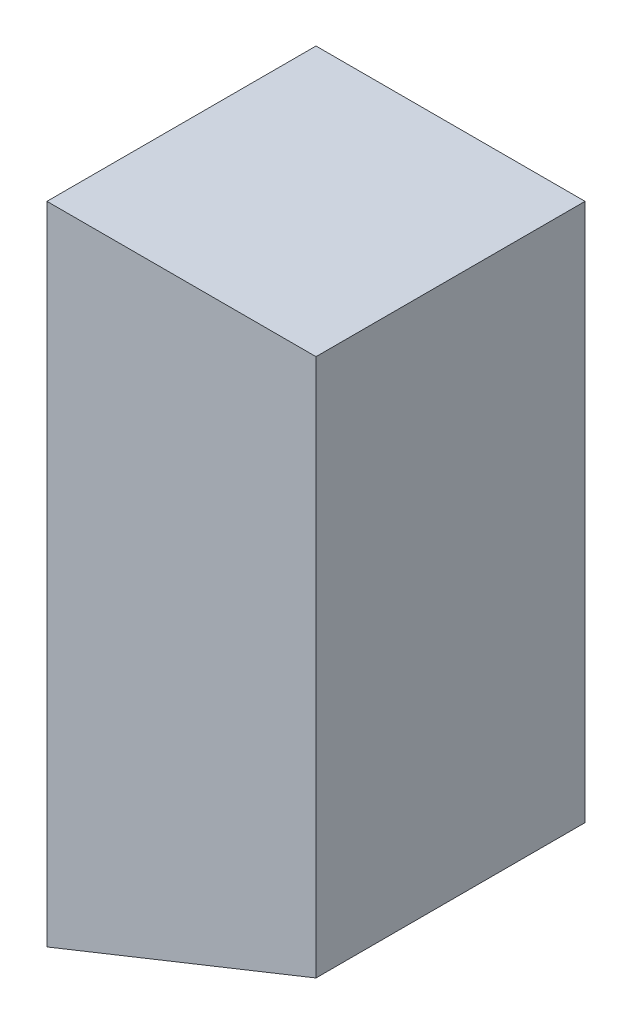
ISO-10303-21;
HEADER;
FILE_DESCRIPTION(('STEP AP214'),'2;1');
FILE_NAME('part.step','',(''),(''),'','','');
FILE_SCHEMA(('AUTOMOTIVE_DESIGN { 1 0 10303 214 1 1 1 1 }'));
ENDSEC;
DATA;
#1=APPLICATION_CONTEXT('core data for automotive mechanical design processes');
#2=APPLICATION_PROTOCOL_DEFINITION('international standard','automotive_design',2000,#1);
#3=PRODUCT_CONTEXT('',#1,'mechanical');
#4=PRODUCT('Part','Part','',(#3));
#5=PRODUCT_RELATED_PRODUCT_CATEGORY('part','',(#4));
#6=PRODUCT_DEFINITION_FORMATION('','',#4);
#7=PRODUCT_DEFINITION_CONTEXT('part definition',#1,'design');
#8=PRODUCT_DEFINITION('design','',#6,#7);
#9=PRODUCT_DEFINITION_SHAPE('','',#8);
#10=(LENGTH_UNIT() NAMED_UNIT(*) SI_UNIT(.MILLI.,.METRE.));
#11=(NAMED_UNIT(*) PLANE_ANGLE_UNIT() SI_UNIT($,.RADIAN.));
#12=(NAMED_UNIT(*) SI_UNIT($,.STERADIAN.) SOLID_ANGLE_UNIT());
#13=UNCERTAINTY_MEASURE_WITH_UNIT(LENGTH_MEASURE(1.E-05),#10,'distance_accuracy_value','');
#14=(GEOMETRIC_REPRESENTATION_CONTEXT(3) GLOBAL_UNCERTAINTY_ASSIGNED_CONTEXT((#13)) GLOBAL_UNIT_ASSIGNED_CONTEXT((#10,
#11,#12)) REPRESENTATION_CONTEXT('',''));
#15=CARTESIAN_POINT('',(0.,0.,0.));
#16=DIRECTION('',(0.,0.,1.));
#17=DIRECTION('',(1.,0.,0.));
#18=AXIS2_PLACEMENT_3D('',#15,#16,#17);
#19=CARTESIAN_POINT('',(0.,0.,0.25));
#20=DIRECTION('',(1.,0.,0.));
#21=DIRECTION('',(0.,1.,0.));
#22=AXIS2_PLACEMENT_3D('',#19,#20,#21);
#23=PLANE('',#22);
#24=DIRECTION('',(0.,-1.,0.));
#25=VECTOR('',#24,1.);
#26=CARTESIAN_POINT('',(0.,0.,0.));
#27=LINE('',#26,#25);
#28=CARTESIAN_POINT('',(0.,0.,0.));
#29=VERTEX_POINT('',#28);
#30=CARTESIAN_POINT('',(0.,-0.6,0.));
#31=VERTEX_POINT('',#30);
#32=EDGE_CURVE('E97',#29,#31,#27,.T.);
#33=ORIENTED_EDGE('',*,*,#32,.T.);
#34=DIRECTION('',(0.,0.,-1.));
#35=VECTOR('',#34,1.);
#36=CARTESIAN_POINT('',(0.,-0.6,0.25));
#37=LINE('',#36,#35);
#38=CARTESIAN_POINT('',(0.,-0.6,0.25));
#39=VERTEX_POINT('',#38);
#40=EDGE_CURVE('E11',#39,#31,#37,.T.);
#41=ORIENTED_EDGE('',*,*,#40,.F.);
#42=DIRECTION('',(0.,-1.,0.));
#43=VECTOR('',#42,1.);
#44=CARTESIAN_POINT('',(0.,0.,0.25));
#45=LINE('',#44,#43);
#46=CARTESIAN_POINT('',(0.,0.,0.25));
#47=VERTEX_POINT('',#46);
#48=EDGE_CURVE('E85',#47,#39,#45,.T.);
#49=ORIENTED_EDGE('',*,*,#48,.F.);
#50=DIRECTION('',(0.,0.,-1.));
#51=VECTOR('',#50,1.);
#52=CARTESIAN_POINT('',(0.,0.,0.25));
#53=LINE('',#52,#51);
#54=EDGE_CURVE('E93',#47,#29,#53,.T.);
#55=ORIENTED_EDGE('',*,*,#54,.T.);
#56=EDGE_LOOP('',(#33,#41,#49,#55));
#57=FACE_BOUND('',#56,.T.);
#58=ADVANCED_FACE('F34',(#57),#23,.F.);
#59=CARTESIAN_POINT('',(0.,-0.6,0.25));
#60=DIRECTION('',(-0.371390676354104,0.92847669088526,0.));
#61=DIRECTION('',(-0.92847669088526,-0.371390676354104,0.));
#62=AXIS2_PLACEMENT_3D('',#59,#60,#61);
#63=PLANE('',#62);
#64=DIRECTION('',(0.92847669088526,0.371390676354104,0.));
#65=VECTOR('',#64,1.);
#66=CARTESIAN_POINT('',(0.,-0.6,0.));
#67=LINE('',#66,#65);
#68=CARTESIAN_POINT('',(0.25,-0.5,0.));
#69=VERTEX_POINT('',#68);
#70=EDGE_CURVE('E89',#31,#69,#67,.T.);
#71=ORIENTED_EDGE('',*,*,#70,.T.);
#72=DIRECTION('',(0.,0.,-1.));
#73=VECTOR('',#72,1.);
#74=CARTESIAN_POINT('',(0.25,-0.5,0.25));
#75=LINE('',#74,#73);
#76=CARTESIAN_POINT('',(0.25,-0.5,0.25));
#77=VERTEX_POINT('',#76);
#78=EDGE_CURVE('E42',#77,#69,#75,.T.);
#79=ORIENTED_EDGE('',*,*,#78,.F.);
#80=DIRECTION('',(0.92847669088526,0.371390676354104,0.));
#81=VECTOR('',#80,1.);
#82=CARTESIAN_POINT('',(0.,-0.6,0.25));
#83=LINE('',#82,#81);
#84=EDGE_CURVE('E80',#39,#77,#83,.T.);
#85=ORIENTED_EDGE('',*,*,#84,.F.);
#86=ORIENTED_EDGE('',*,*,#40,.T.);
#87=EDGE_LOOP('',(#71,#79,#85,#86));
#88=FACE_BOUND('',#87,.T.);
#89=ADVANCED_FACE('F88',(#88),#63,.F.);
#90=CARTESIAN_POINT('',(0.25,0.,0.25));
#91=DIRECTION('',(-1.,0.,0.));
#92=DIRECTION('',(0.,-1.,0.));
#93=AXIS2_PLACEMENT_3D('',#90,#91,#92);
#94=PLANE('',#93);
#95=DIRECTION('',(0.,1.,0.));
#96=VECTOR('',#95,1.);
#97=CARTESIAN_POINT('',(0.25,0.,0.));
#98=LINE('',#97,#96);
#99=CARTESIAN_POINT('',(0.25,0.,0.));
#100=VERTEX_POINT('',#99);
#101=EDGE_CURVE('E67',#69,#100,#98,.T.);
#102=ORIENTED_EDGE('',*,*,#101,.T.);
#103=DIRECTION('',(0.,0.,-1.));
#104=VECTOR('',#103,1.);
#105=CARTESIAN_POINT('',(0.25,0.,0.25));
#106=LINE('',#105,#104);
#107=CARTESIAN_POINT('',(0.25,0.,0.25));
#108=VERTEX_POINT('',#107);
#109=EDGE_CURVE('E90',#108,#100,#106,.T.);
#110=ORIENTED_EDGE('',*,*,#109,.F.);
#111=DIRECTION('',(0.,1.,0.));
#112=VECTOR('',#111,1.);
#113=CARTESIAN_POINT('',(0.25,0.,0.25));
#114=LINE('',#113,#112);
#115=EDGE_CURVE('E83',#77,#108,#114,.T.);
#116=ORIENTED_EDGE('',*,*,#115,.F.);
#117=ORIENTED_EDGE('',*,*,#78,.T.);
#118=EDGE_LOOP('',(#102,#110,#116,#117));
#119=FACE_BOUND('',#118,.T.);
#120=ADVANCED_FACE('F91',(#119),#94,.F.);
#121=CARTESIAN_POINT('',(0.,0.,0.25));
#122=DIRECTION('',(0.,-1.,0.));
#123=DIRECTION('',(0.,0.,-1.));
#124=AXIS2_PLACEMENT_3D('',#121,#122,#123);
#125=PLANE('',#124);
#126=DIRECTION('',(-1.,0.,0.));
#127=VECTOR('',#126,1.);
#128=CARTESIAN_POINT('',(0.,0.,0.));
#129=LINE('',#128,#127);
#130=EDGE_CURVE('E73',#100,#29,#129,.T.);
#131=ORIENTED_EDGE('',*,*,#130,.T.);
#132=ORIENTED_EDGE('',*,*,#54,.F.);
#133=DIRECTION('',(-1.,0.,0.));
#134=VECTOR('',#133,1.);
#135=CARTESIAN_POINT('',(0.,0.,0.25));
#136=LINE('',#135,#134);
#137=EDGE_CURVE('E50',#108,#47,#136,.T.);
#138=ORIENTED_EDGE('',*,*,#137,.F.);
#139=ORIENTED_EDGE('',*,*,#109,.T.);
#140=EDGE_LOOP('',(#131,#132,#138,#139));
#141=FACE_BOUND('',#140,.T.);
#142=ADVANCED_FACE('F104',(#141),#125,.F.);
#143=CARTESIAN_POINT('',(0.,0.,0.25));
#144=DIRECTION('',(0.,0.,1.));
#145=DIRECTION('',(1.,0.,0.));
#146=AXIS2_PLACEMENT_3D('',#143,#144,#145);
#147=PLANE('',#146);
#148=ORIENTED_EDGE('',*,*,#48,.T.);
#149=ORIENTED_EDGE('',*,*,#84,.T.);
#150=ORIENTED_EDGE('',*,*,#115,.T.);
#151=ORIENTED_EDGE('',*,*,#137,.T.);
#152=EDGE_LOOP('',(#148,#149,#150,#151));
#153=FACE_BOUND('',#152,.T.);
#154=ADVANCED_FACE('F81',(#153),#147,.T.);
#155=CARTESIAN_POINT('',(0.,0.,0.));
#156=DIRECTION('',(0.,0.,1.));
#157=DIRECTION('',(1.,0.,0.));
#158=AXIS2_PLACEMENT_3D('',#155,#156,#157);
#159=PLANE('',#158);
#160=ORIENTED_EDGE('',*,*,#32,.F.);
#161=ORIENTED_EDGE('',*,*,#130,.F.);
#162=ORIENTED_EDGE('',*,*,#101,.F.);
#163=ORIENTED_EDGE('',*,*,#70,.F.);
#164=EDGE_LOOP('',(#160,#161,#162,#163));
#165=FACE_BOUND('',#164,.T.);
#166=ADVANCED_FACE('F107',(#165),#159,.F.);
#167=CLOSED_SHELL('',(#58,#89,#120,#142,#154,#166));
#168=MANIFOLD_SOLID_BREP('B2',#167);
#169=ADVANCED_BREP_SHAPE_REPRESENTATION('',(#18,#168),#14);
#170=SHAPE_DEFINITION_REPRESENTATION(#9,#169);
ENDSEC;
END-ISO-10303-21;
